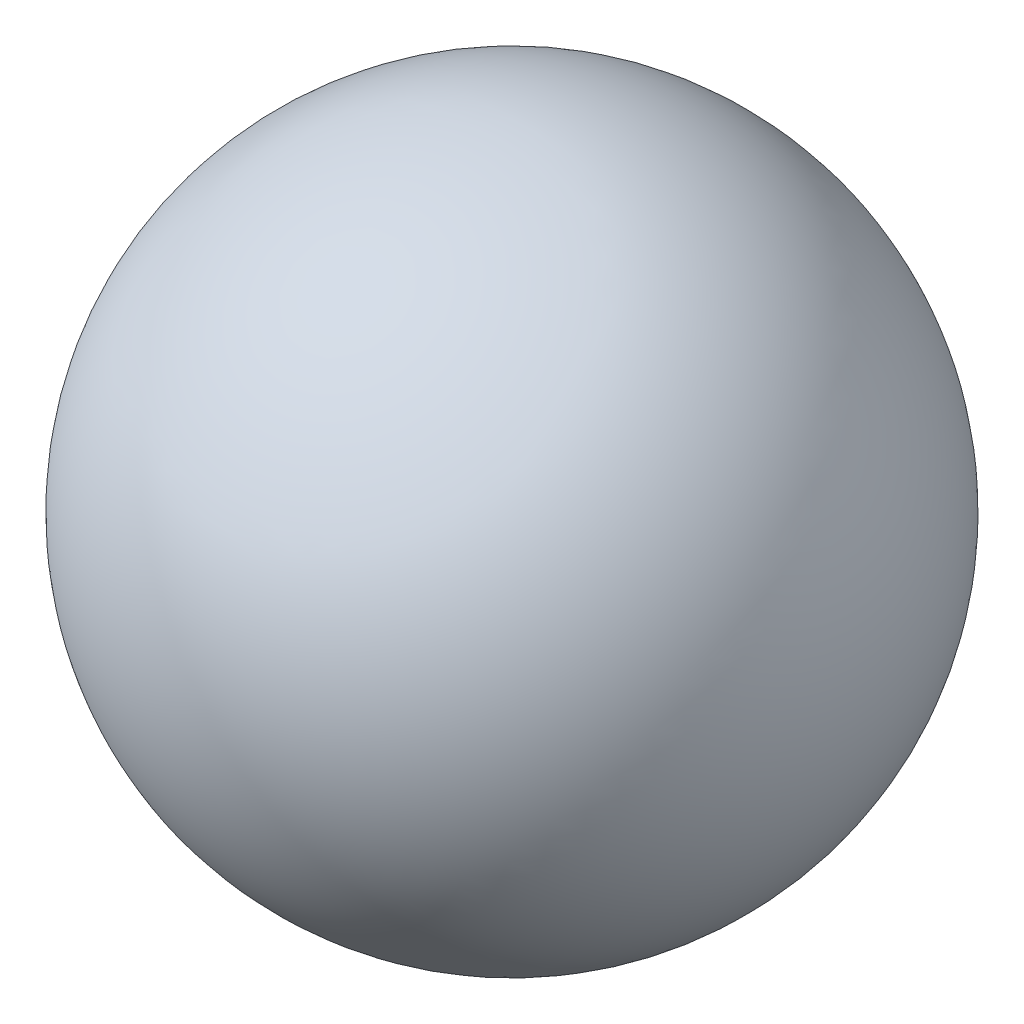
ISO-10303-21;
HEADER;
FILE_DESCRIPTION(('STEP AP214'),'2;1');
FILE_NAME('part.step','',(''),(''),'','','');
FILE_SCHEMA(('AUTOMOTIVE_DESIGN { 1 0 10303 214 1 1 1 1 }'));
ENDSEC;
DATA;
#1=APPLICATION_CONTEXT('core data for automotive mechanical design processes');
#2=APPLICATION_PROTOCOL_DEFINITION('international standard','automotive_design',2000,#1);
#3=PRODUCT_CONTEXT('',#1,'mechanical');
#4=PRODUCT('Part','Part','',(#3));
#5=PRODUCT_RELATED_PRODUCT_CATEGORY('part','',(#4));
#6=PRODUCT_DEFINITION_FORMATION('','',#4);
#7=PRODUCT_DEFINITION_CONTEXT('part definition',#1,'design');
#8=PRODUCT_DEFINITION('design','',#6,#7);
#9=PRODUCT_DEFINITION_SHAPE('','',#8);
#10=(LENGTH_UNIT() NAMED_UNIT(*) SI_UNIT(.MILLI.,.METRE.));
#11=(NAMED_UNIT(*) PLANE_ANGLE_UNIT() SI_UNIT($,.RADIAN.));
#12=(NAMED_UNIT(*) SI_UNIT($,.STERADIAN.) SOLID_ANGLE_UNIT());
#13=UNCERTAINTY_MEASURE_WITH_UNIT(LENGTH_MEASURE(1.E-05),#10,'distance_accuracy_value','');
#14=(GEOMETRIC_REPRESENTATION_CONTEXT(3) GLOBAL_UNCERTAINTY_ASSIGNED_CONTEXT((#13)) GLOBAL_UNIT_ASSIGNED_CONTEXT((#10,
#11,#12)) REPRESENTATION_CONTEXT('',''));
#15=CARTESIAN_POINT('',(0.,0.,0.));
#16=DIRECTION('',(0.,0.,1.));
#17=DIRECTION('',(1.,0.,0.));
#18=AXIS2_PLACEMENT_3D('',#15,#16,#17);
#19=CARTESIAN_POINT('',(0.,0.,0.));
#20=DIRECTION('',(0.,0.,-1.));
#21=DIRECTION('',(1.,0.,0.));
#22=AXIS2_PLACEMENT_3D('',#19,#20,#21);
#23=SPHERICAL_SURFACE('',#22,6.35);
#24=CARTESIAN_POINT('',(0.,0.,-6.35));
#25=VERTEX_POINT('',#24);
#26=VERTEX_LOOP('',#25);
#27=FACE_BOUND('',#26,.T.);
#28=ADVANCED_FACE('F29',(#27),#23,.T.);
#29=CLOSED_SHELL('',(#28));
#30=MANIFOLD_SOLID_BREP('B2',#29);
#31=ADVANCED_BREP_SHAPE_REPRESENTATION('',(#18,#30),#14);
#32=SHAPE_DEFINITION_REPRESENTATION(#9,#31);
ENDSEC;
END-ISO-10303-21;
